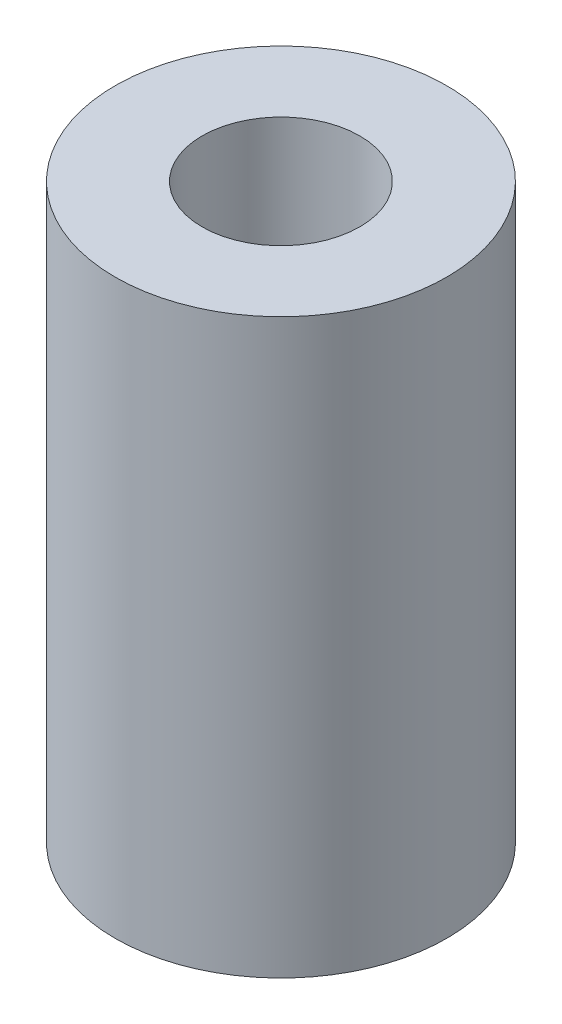
ISO-10303-21;
HEADER;
FILE_DESCRIPTION(('STEP AP214'),'2;1');
FILE_NAME('part.step','',(''),(''),'','','');
FILE_SCHEMA(('AUTOMOTIVE_DESIGN { 1 0 10303 214 1 1 1 1 }'));
ENDSEC;
DATA;
#1=APPLICATION_CONTEXT('core data for automotive mechanical design processes');
#2=APPLICATION_PROTOCOL_DEFINITION('international standard','automotive_design',2000,#1);
#3=PRODUCT_CONTEXT('',#1,'mechanical');
#4=PRODUCT('Part','Part','',(#3));
#5=PRODUCT_RELATED_PRODUCT_CATEGORY('part','',(#4));
#6=PRODUCT_DEFINITION_FORMATION('','',#4);
#7=PRODUCT_DEFINITION_CONTEXT('part definition',#1,'design');
#8=PRODUCT_DEFINITION('design','',#6,#7);
#9=PRODUCT_DEFINITION_SHAPE('','',#8);
#10=(LENGTH_UNIT() NAMED_UNIT(*) SI_UNIT(.MILLI.,.METRE.));
#11=(NAMED_UNIT(*) PLANE_ANGLE_UNIT() SI_UNIT($,.RADIAN.));
#12=(NAMED_UNIT(*) SI_UNIT($,.STERADIAN.) SOLID_ANGLE_UNIT());
#13=UNCERTAINTY_MEASURE_WITH_UNIT(LENGTH_MEASURE(1.E-05),#10,'distance_accuracy_value','');
#14=(GEOMETRIC_REPRESENTATION_CONTEXT(3) GLOBAL_UNCERTAINTY_ASSIGNED_CONTEXT((#13)) GLOBAL_UNIT_ASSIGNED_CONTEXT((#10,
#11,#12)) REPRESENTATION_CONTEXT('',''));
#15=CARTESIAN_POINT('',(0.,0.,0.));
#16=DIRECTION('',(0.,0.,1.));
#17=DIRECTION('',(1.,0.,0.));
#18=AXIS2_PLACEMENT_3D('',#15,#16,#17);
#19=CARTESIAN_POINT('',(0.,17.2702454087939,0.));
#20=DIRECTION('',(0.,-1.,0.));
#21=DIRECTION('',(0.,0.,-1.));
#22=AXIS2_PLACEMENT_3D('',#19,#20,#21);
#23=CYLINDRICAL_SURFACE('',#22,5.);
#24=CARTESIAN_POINT('',(0.,17.2702454087939,0.));
#25=DIRECTION('',(0.,1.,0.));
#26=DIRECTION('',(0.,0.,1.));
#27=AXIS2_PLACEMENT_3D('',#24,#25,#26);
#28=CIRCLE('',#27,5.);
#29=CARTESIAN_POINT('',(0.,17.2702454087939,5.));
#30=VERTEX_POINT('',#29);
#31=EDGE_CURVE('E10',#30,#30,#28,.T.);
#32=ORIENTED_EDGE('',*,*,#31,.F.);
#33=EDGE_LOOP('',(#32));
#34=FACE_BOUND('',#33,.T.);
#35=CARTESIAN_POINT('',(0.,0.,0.));
#36=DIRECTION('',(0.,1.,0.));
#37=DIRECTION('',(0.,0.,1.));
#38=AXIS2_PLACEMENT_3D('',#35,#36,#37);
#39=CIRCLE('',#38,5.);
#40=CARTESIAN_POINT('',(0.,0.,5.));
#41=VERTEX_POINT('',#40);
#42=EDGE_CURVE('E37',#41,#41,#39,.T.);
#43=ORIENTED_EDGE('',*,*,#42,.T.);
#44=EDGE_LOOP('',(#43));
#45=FACE_BOUND('',#44,.T.);
#46=ADVANCED_FACE('F40',(#34,#45),#23,.T.);
#47=CARTESIAN_POINT('',(0.,17.2702454087939,0.));
#48=DIRECTION('',(0.,1.,0.));
#49=DIRECTION('',(0.,0.,1.));
#50=AXIS2_PLACEMENT_3D('',#47,#48,#49);
#51=PLANE('',#50);
#52=CARTESIAN_POINT('',(0.,17.2702454087939,0.));
#53=DIRECTION('',(0.,1.,0.));
#54=DIRECTION('',(0.,0.,1.));
#55=AXIS2_PLACEMENT_3D('',#52,#53,#54);
#56=CIRCLE('',#55,2.37746011083028);
#57=CARTESIAN_POINT('',(0.,17.2702454087939,2.37746011083028));
#58=VERTEX_POINT('',#57);
#59=EDGE_CURVE('E50',#58,#58,#56,.T.);
#60=ORIENTED_EDGE('',*,*,#59,.F.);
#61=EDGE_LOOP('',(#60));
#62=FACE_BOUND('',#61,.T.);
#63=ORIENTED_EDGE('',*,*,#31,.T.);
#64=EDGE_LOOP('',(#63));
#65=FACE_BOUND('',#64,.T.);
#66=ADVANCED_FACE('F59',(#62,#65),#51,.T.);
#67=CARTESIAN_POINT('',(0.,0.,0.));
#68=DIRECTION('',(0.,1.,0.));
#69=DIRECTION('',(0.,0.,1.));
#70=AXIS2_PLACEMENT_3D('',#67,#68,#69);
#71=PLANE('',#70);
#72=CARTESIAN_POINT('',(0.,0.,0.));
#73=DIRECTION('',(0.,1.,0.));
#74=DIRECTION('',(0.,0.,1.));
#75=AXIS2_PLACEMENT_3D('',#72,#73,#74);
#76=CIRCLE('',#75,2.37746011083028);
#77=CARTESIAN_POINT('',(0.,0.,2.37746011083028));
#78=VERTEX_POINT('',#77);
#79=EDGE_CURVE('E47',#78,#78,#76,.T.);
#80=ORIENTED_EDGE('',*,*,#79,.T.);
#81=EDGE_LOOP('',(#80));
#82=FACE_BOUND('',#81,.T.);
#83=ORIENTED_EDGE('',*,*,#42,.F.);
#84=EDGE_LOOP('',(#83));
#85=FACE_BOUND('',#84,.T.);
#86=ADVANCED_FACE('F58',(#82,#85),#71,.F.);
#87=CARTESIAN_POINT('',(0.,17.2702454087939,0.));
#88=DIRECTION('',(0.,-1.,0.));
#89=DIRECTION('',(0.,0.,-1.));
#90=AXIS2_PLACEMENT_3D('',#87,#88,#89);
#91=CYLINDRICAL_SURFACE('',#90,2.37746011083028);
#92=ORIENTED_EDGE('',*,*,#59,.T.);
#93=EDGE_LOOP('',(#92));
#94=FACE_BOUND('',#93,.T.);
#95=ORIENTED_EDGE('',*,*,#79,.F.);
#96=EDGE_LOOP('',(#95));
#97=FACE_BOUND('',#96,.T.);
#98=ADVANCED_FACE('F54',(#94,#97),#91,.F.);
#99=CLOSED_SHELL('',(#46,#66,#86,#98));
#100=MANIFOLD_SOLID_BREP('B2',#99);
#101=ADVANCED_BREP_SHAPE_REPRESENTATION('',(#18,#100),#14);
#102=SHAPE_DEFINITION_REPRESENTATION(#9,#101);
ENDSEC;
END-ISO-10303-21;
